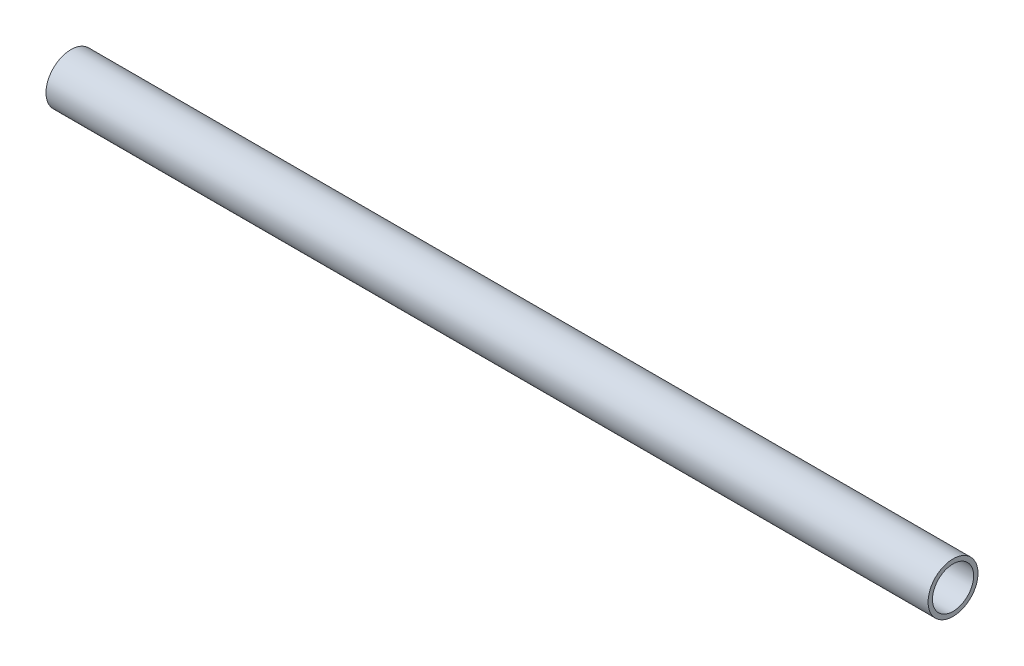
ISO-10303-21;
HEADER;
FILE_DESCRIPTION(('STEP AP214'),'2;1');
FILE_NAME('part.step','',(''),(''),'','','');
FILE_SCHEMA(('AUTOMOTIVE_DESIGN { 1 0 10303 214 1 1 1 1 }'));
ENDSEC;
DATA;
#1=APPLICATION_CONTEXT('core data for automotive mechanical design processes');
#2=APPLICATION_PROTOCOL_DEFINITION('international standard','automotive_design',2000,#1);
#3=PRODUCT_CONTEXT('',#1,'mechanical');
#4=PRODUCT('Part','Part','',(#3));
#5=PRODUCT_RELATED_PRODUCT_CATEGORY('part','',(#4));
#6=PRODUCT_DEFINITION_FORMATION('','',#4);
#7=PRODUCT_DEFINITION_CONTEXT('part definition',#1,'design');
#8=PRODUCT_DEFINITION('design','',#6,#7);
#9=PRODUCT_DEFINITION_SHAPE('','',#8);
#10=(LENGTH_UNIT() NAMED_UNIT(*) SI_UNIT(.MILLI.,.METRE.));
#11=(NAMED_UNIT(*) PLANE_ANGLE_UNIT() SI_UNIT($,.RADIAN.));
#12=(NAMED_UNIT(*) SI_UNIT($,.STERADIAN.) SOLID_ANGLE_UNIT());
#13=UNCERTAINTY_MEASURE_WITH_UNIT(LENGTH_MEASURE(1.E-05),#10,'distance_accuracy_value','');
#14=(GEOMETRIC_REPRESENTATION_CONTEXT(3) GLOBAL_UNCERTAINTY_ASSIGNED_CONTEXT((#13)) GLOBAL_UNIT_ASSIGNED_CONTEXT((#10,
#11,#12)) REPRESENTATION_CONTEXT('',''));
#15=CARTESIAN_POINT('',(0.,0.,0.));
#16=DIRECTION('',(0.,0.,1.));
#17=DIRECTION('',(1.,0.,0.));
#18=AXIS2_PLACEMENT_3D('',#15,#16,#17);
#19=CARTESIAN_POINT('',(-194.95770220467,647.702421083176,0.));
#20=DIRECTION('',(1.,0.,0.));
#21=DIRECTION('',(0.,0.,-1.));
#22=AXIS2_PLACEMENT_3D('',#19,#20,#21);
#23=CYLINDRICAL_SURFACE('',#22,2.6162);
#24=CARTESIAN_POINT('',(-194.95770220467,647.702421083176,0.));
#25=DIRECTION('',(-1.,0.,0.));
#26=DIRECTION('',(0.,-1.,0.));
#27=AXIS2_PLACEMENT_3D('',#24,#25,#26);
#28=CIRCLE('',#27,2.6162);
#29=CARTESIAN_POINT('',(-194.95770220467,645.086221083176,0.));
#30=VERTEX_POINT('',#29);
#31=EDGE_CURVE('E44',#30,#30,#28,.T.);
#32=ORIENTED_EDGE('',*,*,#31,.T.);
#33=EDGE_LOOP('',(#32));
#34=FACE_BOUND('',#33,.T.);
#35=CARTESIAN_POINT('',(-82.7560717613949,647.702421083176,0.));
#36=DIRECTION('',(-1.,0.,0.));
#37=DIRECTION('',(0.,-1.,0.));
#38=AXIS2_PLACEMENT_3D('',#35,#36,#37);
#39=CIRCLE('',#38,2.6162);
#40=CARTESIAN_POINT('',(-82.7560717613949,645.086221083176,0.));
#41=VERTEX_POINT('',#40);
#42=EDGE_CURVE('E50',#41,#41,#39,.T.);
#43=ORIENTED_EDGE('',*,*,#42,.F.);
#44=EDGE_LOOP('',(#43));
#45=FACE_BOUND('',#44,.T.);
#46=ADVANCED_FACE('F37',(#34,#45),#23,.F.);
#47=CARTESIAN_POINT('',(-194.95770220467,647.702421083176,0.));
#48=DIRECTION('',(1.,0.,0.));
#49=DIRECTION('',(0.,0.,-1.));
#50=AXIS2_PLACEMENT_3D('',#47,#48,#49);
#51=CYLINDRICAL_SURFACE('',#50,3.175);
#52=CARTESIAN_POINT('',(-194.95770220467,647.702421083176,0.));
#53=DIRECTION('',(-1.,0.,0.));
#54=DIRECTION('',(0.,-1.,0.));
#55=AXIS2_PLACEMENT_3D('',#52,#53,#54);
#56=CIRCLE('',#55,3.175);
#57=CARTESIAN_POINT('',(-194.95770220467,644.527421083176,0.));
#58=VERTEX_POINT('',#57);
#59=EDGE_CURVE('E11',#58,#58,#56,.T.);
#60=ORIENTED_EDGE('',*,*,#59,.F.);
#61=EDGE_LOOP('',(#60));
#62=FACE_BOUND('',#61,.T.);
#63=CARTESIAN_POINT('',(-82.7560717613949,647.702421083176,0.));
#64=DIRECTION('',(-1.,0.,0.));
#65=DIRECTION('',(0.,-1.,0.));
#66=AXIS2_PLACEMENT_3D('',#63,#64,#65);
#67=CIRCLE('',#66,3.175);
#68=CARTESIAN_POINT('',(-82.7560717613949,644.527421083176,0.));
#69=VERTEX_POINT('',#68);
#70=EDGE_CURVE('E40',#69,#69,#67,.T.);
#71=ORIENTED_EDGE('',*,*,#70,.T.);
#72=EDGE_LOOP('',(#71));
#73=FACE_BOUND('',#72,.T.);
#74=ADVANCED_FACE('F57',(#62,#73),#51,.T.);
#75=CARTESIAN_POINT('',(-194.95770220467,647.702421083176,0.));
#76=DIRECTION('',(-1.,0.,0.));
#77=DIRECTION('',(0.,-1.,0.));
#78=AXIS2_PLACEMENT_3D('',#75,#76,#77);
#79=PLANE('',#78);
#80=ORIENTED_EDGE('',*,*,#31,.F.);
#81=EDGE_LOOP('',(#80));
#82=FACE_BOUND('',#81,.T.);
#83=ORIENTED_EDGE('',*,*,#59,.T.);
#84=EDGE_LOOP('',(#83));
#85=FACE_BOUND('',#84,.T.);
#86=ADVANCED_FACE('F61',(#82,#85),#79,.T.);
#87=CARTESIAN_POINT('',(-82.7560717613949,647.702421083176,0.));
#88=DIRECTION('',(-1.,0.,0.));
#89=DIRECTION('',(0.,-1.,0.));
#90=AXIS2_PLACEMENT_3D('',#87,#88,#89);
#91=PLANE('',#90);
#92=ORIENTED_EDGE('',*,*,#42,.T.);
#93=EDGE_LOOP('',(#92));
#94=FACE_BOUND('',#93,.T.);
#95=ORIENTED_EDGE('',*,*,#70,.F.);
#96=EDGE_LOOP('',(#95));
#97=FACE_BOUND('',#96,.T.);
#98=ADVANCED_FACE('F59',(#94,#97),#91,.F.);
#99=CLOSED_SHELL('',(#46,#74,#86,#98));
#100=MANIFOLD_SOLID_BREP('B2',#99);
#101=ADVANCED_BREP_SHAPE_REPRESENTATION('',(#18,#100),#14);
#102=SHAPE_DEFINITION_REPRESENTATION(#9,#101);
ENDSEC;
END-ISO-10303-21;
